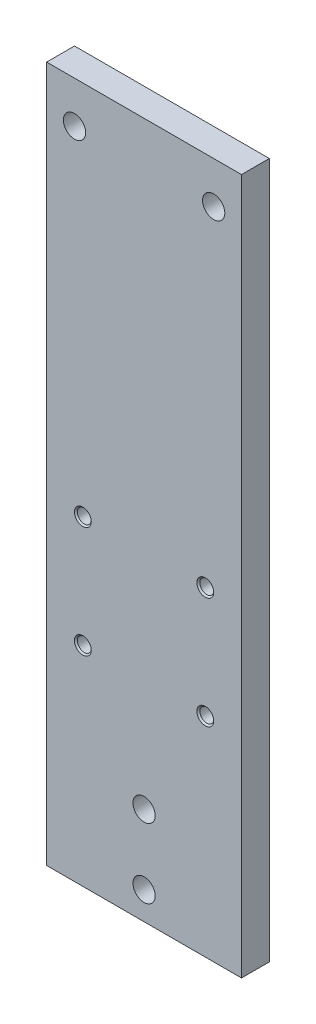
ISO-10303-21;
HEADER;
FILE_DESCRIPTION(('STEP AP214'),'2;1');
FILE_NAME('part.step','',(''),(''),'','','');
FILE_SCHEMA(('AUTOMOTIVE_DESIGN { 1 0 10303 214 1 1 1 1 }'));
ENDSEC;
DATA;
#1=APPLICATION_CONTEXT('core data for automotive mechanical design processes');
#2=APPLICATION_PROTOCOL_DEFINITION('international standard','automotive_design',2000,#1);
#3=PRODUCT_CONTEXT('',#1,'mechanical');
#4=PRODUCT('Part','Part','',(#3));
#5=PRODUCT_RELATED_PRODUCT_CATEGORY('part','',(#4));
#6=PRODUCT_DEFINITION_FORMATION('','',#4);
#7=PRODUCT_DEFINITION_CONTEXT('part definition',#1,'design');
#8=PRODUCT_DEFINITION('design','',#6,#7);
#9=PRODUCT_DEFINITION_SHAPE('','',#8);
#10=(LENGTH_UNIT() NAMED_UNIT(*) SI_UNIT(.MILLI.,.METRE.));
#11=(NAMED_UNIT(*) PLANE_ANGLE_UNIT() SI_UNIT($,.RADIAN.));
#12=(NAMED_UNIT(*) SI_UNIT($,.STERADIAN.) SOLID_ANGLE_UNIT());
#13=UNCERTAINTY_MEASURE_WITH_UNIT(LENGTH_MEASURE(1.E-05),#10,'distance_accuracy_value','');
#14=(GEOMETRIC_REPRESENTATION_CONTEXT(3) GLOBAL_UNCERTAINTY_ASSIGNED_CONTEXT((#13)) GLOBAL_UNIT_ASSIGNED_CONTEXT((#10,
#11,#12)) REPRESENTATION_CONTEXT('',''));
#15=CARTESIAN_POINT('',(0.,0.,0.));
#16=DIRECTION('',(0.,0.,1.));
#17=DIRECTION('',(1.,0.,0.));
#18=AXIS2_PLACEMENT_3D('',#15,#16,#17);
#19=CARTESIAN_POINT('',(0.,0.,10.));
#20=DIRECTION('',(0.,0.,-1.));
#21=DIRECTION('',(-1.,0.,0.));
#22=AXIS2_PLACEMENT_3D('',#19,#20,#21);
#23=PLANE('',#22);
#24=CARTESIAN_POINT('',(0.,-115.,10.));
#25=DIRECTION('',(0.,0.,1.));
#26=DIRECTION('',(1.,0.,0.));
#27=AXIS2_PLACEMENT_3D('',#24,#25,#26);
#28=CIRCLE('',#27,4.00000000000001);
#29=CARTESIAN_POINT('',(4.00000000000001,-115.,10.));
#30=VERTEX_POINT('',#29);
#31=EDGE_CURVE('E170',#30,#30,#28,.T.);
#32=ORIENTED_EDGE('',*,*,#31,.F.);
#33=EDGE_LOOP('',(#32));
#34=FACE_BOUND('',#33,.T.);
#35=CARTESIAN_POINT('',(0.,-90.,10.));
#36=DIRECTION('',(0.,0.,1.));
#37=DIRECTION('',(1.,0.,0.));
#38=AXIS2_PLACEMENT_3D('',#35,#36,#37);
#39=CIRCLE('',#38,4.00000000000001);
#40=CARTESIAN_POINT('',(4.00000000000001,-90.,10.));
#41=VERTEX_POINT('',#40);
#42=EDGE_CURVE('E164',#41,#41,#39,.T.);
#43=ORIENTED_EDGE('',*,*,#42,.F.);
#44=EDGE_LOOP('',(#43));
#45=FACE_BOUND('',#44,.T.);
#46=CARTESIAN_POINT('',(-22.,-10.,10.));
#47=DIRECTION('',(0.,0.,1.));
#48=DIRECTION('',(1.,0.,0.));
#49=AXIS2_PLACEMENT_3D('',#46,#47,#48);
#50=CIRCLE('',#49,3.025);
#51=CARTESIAN_POINT('',(-18.975,-10.,10.));
#52=VERTEX_POINT('',#51);
#53=EDGE_CURVE('E160',#52,#52,#50,.T.);
#54=ORIENTED_EDGE('',*,*,#53,.F.);
#55=EDGE_LOOP('',(#54));
#56=FACE_BOUND('',#55,.T.);
#57=CARTESIAN_POINT('',(22.,-10.,10.));
#58=DIRECTION('',(0.,0.,1.));
#59=DIRECTION('',(1.,0.,0.));
#60=AXIS2_PLACEMENT_3D('',#57,#58,#59);
#61=CIRCLE('',#60,3.025);
#62=CARTESIAN_POINT('',(25.025,-10.,10.));
#63=VERTEX_POINT('',#62);
#64=EDGE_CURVE('E151',#63,#63,#61,.T.);
#65=ORIENTED_EDGE('',*,*,#64,.F.);
#66=EDGE_LOOP('',(#65));
#67=FACE_BOUND('',#66,.T.);
#68=CARTESIAN_POINT('',(22.,-50.,10.));
#69=DIRECTION('',(0.,0.,1.));
#70=DIRECTION('',(1.,0.,0.));
#71=AXIS2_PLACEMENT_3D('',#68,#69,#70);
#72=CIRCLE('',#71,3.025);
#73=CARTESIAN_POINT('',(25.025,-50.,10.));
#74=VERTEX_POINT('',#73);
#75=EDGE_CURVE('E142',#74,#74,#72,.T.);
#76=ORIENTED_EDGE('',*,*,#75,.F.);
#77=EDGE_LOOP('',(#76));
#78=FACE_BOUND('',#77,.T.);
#79=CARTESIAN_POINT('',(-22.,-50.,10.));
#80=DIRECTION('',(0.,0.,1.));
#81=DIRECTION('',(1.,0.,0.));
#82=AXIS2_PLACEMENT_3D('',#79,#80,#81);
#83=CIRCLE('',#82,3.025);
#84=CARTESIAN_POINT('',(-18.975,-50.,10.));
#85=VERTEX_POINT('',#84);
#86=EDGE_CURVE('E133',#85,#85,#83,.T.);
#87=ORIENTED_EDGE('',*,*,#86,.F.);
#88=EDGE_LOOP('',(#87));
#89=FACE_BOUND('',#88,.T.);
#90=DIRECTION('',(0.,1.,0.));
#91=VECTOR('',#90,1.);
#92=CARTESIAN_POINT('',(35.,-125.,10.));
#93=LINE('',#92,#91);
#94=CARTESIAN_POINT('',(35.,-125.,10.));
#95=VERTEX_POINT('',#94);
#96=CARTESIAN_POINT('',(35.,125.,10.));
#97=VERTEX_POINT('',#96);
#98=EDGE_CURVE('E89',#95,#97,#93,.T.);
#99=ORIENTED_EDGE('',*,*,#98,.T.);
#100=DIRECTION('',(-1.,0.,0.));
#101=VECTOR('',#100,1.);
#102=CARTESIAN_POINT('',(-35.,125.,10.));
#103=LINE('',#102,#101);
#104=CARTESIAN_POINT('',(-35.,125.,10.));
#105=VERTEX_POINT('',#104);
#106=EDGE_CURVE('E84',#97,#105,#103,.T.);
#107=ORIENTED_EDGE('',*,*,#106,.T.);
#108=DIRECTION('',(0.,-1.,0.));
#109=VECTOR('',#108,1.);
#110=CARTESIAN_POINT('',(-35.,-125.,10.));
#111=LINE('',#110,#109);
#112=CARTESIAN_POINT('',(-35.,-125.,10.));
#113=VERTEX_POINT('',#112);
#114=EDGE_CURVE('E87',#105,#113,#111,.T.);
#115=ORIENTED_EDGE('',*,*,#114,.T.);
#116=DIRECTION('',(1.,0.,0.));
#117=VECTOR('',#116,1.);
#118=CARTESIAN_POINT('',(-35.,-125.,10.));
#119=LINE('',#118,#117);
#120=EDGE_CURVE('E54',#113,#95,#119,.T.);
#121=ORIENTED_EDGE('',*,*,#120,.T.);
#122=EDGE_LOOP('',(#99,#107,#115,#121));
#123=FACE_BOUND('',#122,.T.);
#124=CARTESIAN_POINT('',(-25.,110.,10.));
#125=DIRECTION('',(0.,0.,1.));
#126=DIRECTION('',(1.,0.,0.));
#127=AXIS2_PLACEMENT_3D('',#124,#125,#126);
#128=CIRCLE('',#127,4.);
#129=CARTESIAN_POINT('',(-21.,110.,10.));
#130=VERTEX_POINT('',#129);
#131=EDGE_CURVE('E104',#130,#130,#128,.T.);
#132=ORIENTED_EDGE('',*,*,#131,.F.);
#133=EDGE_LOOP('',(#132));
#134=FACE_BOUND('',#133,.T.);
#135=CARTESIAN_POINT('',(25.,110.,10.));
#136=DIRECTION('',(0.,0.,1.));
#137=DIRECTION('',(1.,0.,0.));
#138=AXIS2_PLACEMENT_3D('',#135,#136,#137);
#139=CIRCLE('',#138,4.);
#140=CARTESIAN_POINT('',(29.,110.,10.));
#141=VERTEX_POINT('',#140);
#142=EDGE_CURVE('E119',#141,#141,#139,.T.);
#143=ORIENTED_EDGE('',*,*,#142,.F.);
#144=EDGE_LOOP('',(#143));
#145=FACE_BOUND('',#144,.T.);
#146=ADVANCED_FACE('F37',(#34,#45,#56,#67,#78,#89,#123,#134,#145),#23,.F.);
#147=CARTESIAN_POINT('',(0.,0.,0.));
#148=DIRECTION('',(0.,0.,-1.));
#149=DIRECTION('',(-1.,0.,0.));
#150=AXIS2_PLACEMENT_3D('',#147,#148,#149);
#151=PLANE('',#150);
#152=CARTESIAN_POINT('',(0.,-115.,0.));
#153=DIRECTION('',(0.,0.,1.));
#154=DIRECTION('',(1.,0.,0.));
#155=AXIS2_PLACEMENT_3D('',#152,#153,#154);
#156=CIRCLE('',#155,4.00000000000001);
#157=CARTESIAN_POINT('',(4.00000000000001,-115.,0.));
#158=VERTEX_POINT('',#157);
#159=EDGE_CURVE('E167',#158,#158,#156,.T.);
#160=ORIENTED_EDGE('',*,*,#159,.T.);
#161=EDGE_LOOP('',(#160));
#162=FACE_BOUND('',#161,.T.);
#163=CARTESIAN_POINT('',(0.,-90.,0.));
#164=DIRECTION('',(0.,0.,1.));
#165=DIRECTION('',(1.,0.,0.));
#166=AXIS2_PLACEMENT_3D('',#163,#164,#165);
#167=CIRCLE('',#166,4.00000000000001);
#168=CARTESIAN_POINT('',(4.00000000000001,-90.,0.));
#169=VERTEX_POINT('',#168);
#170=EDGE_CURVE('E163',#169,#169,#167,.T.);
#171=ORIENTED_EDGE('',*,*,#170,.T.);
#172=EDGE_LOOP('',(#171));
#173=FACE_BOUND('',#172,.T.);
#174=CARTESIAN_POINT('',(-22.,-10.,0.));
#175=DIRECTION('',(0.,0.,1.));
#176=DIRECTION('',(1.,0.,0.));
#177=AXIS2_PLACEMENT_3D('',#174,#175,#176);
#178=CIRCLE('',#177,2.5);
#179=CARTESIAN_POINT('',(-19.5,-10.,0.));
#180=VERTEX_POINT('',#179);
#181=EDGE_CURVE('E154',#180,#180,#178,.T.);
#182=ORIENTED_EDGE('',*,*,#181,.T.);
#183=EDGE_LOOP('',(#182));
#184=FACE_BOUND('',#183,.T.);
#185=CARTESIAN_POINT('',(22.,-10.,0.));
#186=DIRECTION('',(0.,0.,1.));
#187=DIRECTION('',(1.,0.,0.));
#188=AXIS2_PLACEMENT_3D('',#185,#186,#187);
#189=CIRCLE('',#188,2.5);
#190=CARTESIAN_POINT('',(24.5,-10.,0.));
#191=VERTEX_POINT('',#190);
#192=EDGE_CURVE('E145',#191,#191,#189,.T.);
#193=ORIENTED_EDGE('',*,*,#192,.T.);
#194=EDGE_LOOP('',(#193));
#195=FACE_BOUND('',#194,.T.);
#196=CARTESIAN_POINT('',(22.,-50.,0.));
#197=DIRECTION('',(0.,0.,1.));
#198=DIRECTION('',(1.,0.,0.));
#199=AXIS2_PLACEMENT_3D('',#196,#197,#198);
#200=CIRCLE('',#199,2.5);
#201=CARTESIAN_POINT('',(24.5,-50.,0.));
#202=VERTEX_POINT('',#201);
#203=EDGE_CURVE('E136',#202,#202,#200,.T.);
#204=ORIENTED_EDGE('',*,*,#203,.T.);
#205=EDGE_LOOP('',(#204));
#206=FACE_BOUND('',#205,.T.);
#207=CARTESIAN_POINT('',(-22.,-50.,0.));
#208=DIRECTION('',(0.,0.,1.));
#209=DIRECTION('',(1.,0.,0.));
#210=AXIS2_PLACEMENT_3D('',#207,#208,#209);
#211=CIRCLE('',#210,2.5);
#212=CARTESIAN_POINT('',(-19.5,-50.,0.));
#213=VERTEX_POINT('',#212);
#214=EDGE_CURVE('E125',#213,#213,#211,.T.);
#215=ORIENTED_EDGE('',*,*,#214,.T.);
#216=EDGE_LOOP('',(#215));
#217=FACE_BOUND('',#216,.T.);
#218=CARTESIAN_POINT('',(-25.,110.,0.));
#219=DIRECTION('',(0.,0.,1.));
#220=DIRECTION('',(1.,0.,0.));
#221=AXIS2_PLACEMENT_3D('',#218,#219,#220);
#222=CIRCLE('',#221,4.);
#223=CARTESIAN_POINT('',(-21.,110.,0.));
#224=VERTEX_POINT('',#223);
#225=EDGE_CURVE('E116',#224,#224,#222,.T.);
#226=ORIENTED_EDGE('',*,*,#225,.T.);
#227=EDGE_LOOP('',(#226));
#228=FACE_BOUND('',#227,.T.);
#229=DIRECTION('',(0.,1.,0.));
#230=VECTOR('',#229,1.);
#231=CARTESIAN_POINT('',(35.,-125.,0.));
#232=LINE('',#231,#230);
#233=CARTESIAN_POINT('',(35.,-125.,0.));
#234=VERTEX_POINT('',#233);
#235=CARTESIAN_POINT('',(35.,125.,0.));
#236=VERTEX_POINT('',#235);
#237=EDGE_CURVE('E101',#234,#236,#232,.T.);
#238=ORIENTED_EDGE('',*,*,#237,.F.);
#239=DIRECTION('',(1.,0.,0.));
#240=VECTOR('',#239,1.);
#241=CARTESIAN_POINT('',(-35.,-125.,0.));
#242=LINE('',#241,#240);
#243=CARTESIAN_POINT('',(-35.,-125.,0.));
#244=VERTEX_POINT('',#243);
#245=EDGE_CURVE('E77',#244,#234,#242,.T.);
#246=ORIENTED_EDGE('',*,*,#245,.F.);
#247=DIRECTION('',(0.,-1.,0.));
#248=VECTOR('',#247,1.);
#249=CARTESIAN_POINT('',(-35.,-125.,0.));
#250=LINE('',#249,#248);
#251=CARTESIAN_POINT('',(-35.,125.,0.));
#252=VERTEX_POINT('',#251);
#253=EDGE_CURVE('E71',#252,#244,#250,.T.);
#254=ORIENTED_EDGE('',*,*,#253,.F.);
#255=DIRECTION('',(-1.,0.,0.));
#256=VECTOR('',#255,1.);
#257=CARTESIAN_POINT('',(-35.,125.,0.));
#258=LINE('',#257,#256);
#259=EDGE_CURVE('E93',#236,#252,#258,.T.);
#260=ORIENTED_EDGE('',*,*,#259,.F.);
#261=EDGE_LOOP('',(#238,#246,#254,#260));
#262=FACE_BOUND('',#261,.T.);
#263=CARTESIAN_POINT('',(25.,110.,0.));
#264=DIRECTION('',(0.,0.,1.));
#265=DIRECTION('',(1.,0.,0.));
#266=AXIS2_PLACEMENT_3D('',#263,#264,#265);
#267=CIRCLE('',#266,4.);
#268=CARTESIAN_POINT('',(29.,110.,0.));
#269=VERTEX_POINT('',#268);
#270=EDGE_CURVE('E122',#269,#269,#267,.T.);
#271=ORIENTED_EDGE('',*,*,#270,.T.);
#272=EDGE_LOOP('',(#271));
#273=FACE_BOUND('',#272,.T.);
#274=ADVANCED_FACE('F112',(#162,#173,#184,#195,#206,#217,#228,#262,#273),#151,.T.);
#275=CARTESIAN_POINT('',(35.,-125.,10.));
#276=DIRECTION('',(-1.,0.,0.));
#277=DIRECTION('',(0.,0.,1.));
#278=AXIS2_PLACEMENT_3D('',#275,#276,#277);
#279=PLANE('',#278);
#280=ORIENTED_EDGE('',*,*,#237,.T.);
#281=DIRECTION('',(0.,0.,-1.));
#282=VECTOR('',#281,1.);
#283=CARTESIAN_POINT('',(35.,125.,10.));
#284=LINE('',#283,#282);
#285=EDGE_CURVE('E11',#97,#236,#284,.T.);
#286=ORIENTED_EDGE('',*,*,#285,.F.);
#287=ORIENTED_EDGE('',*,*,#98,.F.);
#288=DIRECTION('',(0.,0.,-1.));
#289=VECTOR('',#288,1.);
#290=CARTESIAN_POINT('',(35.,-125.,10.));
#291=LINE('',#290,#289);
#292=EDGE_CURVE('E97',#95,#234,#291,.T.);
#293=ORIENTED_EDGE('',*,*,#292,.T.);
#294=EDGE_LOOP('',(#280,#286,#287,#293));
#295=FACE_BOUND('',#294,.T.);
#296=ADVANCED_FACE('F39',(#295),#279,.F.);
#297=CARTESIAN_POINT('',(-35.,125.,10.));
#298=DIRECTION('',(0.,-1.,0.));
#299=DIRECTION('',(0.,0.,-1.));
#300=AXIS2_PLACEMENT_3D('',#297,#298,#299);
#301=PLANE('',#300);
#302=ORIENTED_EDGE('',*,*,#259,.T.);
#303=DIRECTION('',(0.,0.,-1.));
#304=VECTOR('',#303,1.);
#305=CARTESIAN_POINT('',(-35.,125.,10.));
#306=LINE('',#305,#304);
#307=EDGE_CURVE('E46',#105,#252,#306,.T.);
#308=ORIENTED_EDGE('',*,*,#307,.F.);
#309=ORIENTED_EDGE('',*,*,#106,.F.);
#310=ORIENTED_EDGE('',*,*,#285,.T.);
#311=EDGE_LOOP('',(#302,#308,#309,#310));
#312=FACE_BOUND('',#311,.T.);
#313=ADVANCED_FACE('F92',(#312),#301,.F.);
#314=CARTESIAN_POINT('',(-35.,-125.,10.));
#315=DIRECTION('',(1.,0.,0.));
#316=DIRECTION('',(0.,0.,-1.));
#317=AXIS2_PLACEMENT_3D('',#314,#315,#316);
#318=PLANE('',#317);
#319=ORIENTED_EDGE('',*,*,#253,.T.);
#320=DIRECTION('',(0.,0.,-1.));
#321=VECTOR('',#320,1.);
#322=CARTESIAN_POINT('',(-35.,-125.,10.));
#323=LINE('',#322,#321);
#324=EDGE_CURVE('E94',#113,#244,#323,.T.);
#325=ORIENTED_EDGE('',*,*,#324,.F.);
#326=ORIENTED_EDGE('',*,*,#114,.F.);
#327=ORIENTED_EDGE('',*,*,#307,.T.);
#328=EDGE_LOOP('',(#319,#325,#326,#327));
#329=FACE_BOUND('',#328,.T.);
#330=ADVANCED_FACE('F95',(#329),#318,.F.);
#331=CARTESIAN_POINT('',(-35.,-125.,10.));
#332=DIRECTION('',(0.,1.,0.));
#333=DIRECTION('',(0.,0.,1.));
#334=AXIS2_PLACEMENT_3D('',#331,#332,#333);
#335=PLANE('',#334);
#336=ORIENTED_EDGE('',*,*,#245,.T.);
#337=ORIENTED_EDGE('',*,*,#292,.F.);
#338=ORIENTED_EDGE('',*,*,#120,.F.);
#339=ORIENTED_EDGE('',*,*,#324,.T.);
#340=EDGE_LOOP('',(#336,#337,#338,#339));
#341=FACE_BOUND('',#340,.T.);
#342=ADVANCED_FACE('F109',(#341),#335,.F.);
#343=CARTESIAN_POINT('',(-25.,110.,10.));
#344=DIRECTION('',(0.,0.,-1.));
#345=DIRECTION('',(-1.,0.,0.));
#346=AXIS2_PLACEMENT_3D('',#343,#344,#345);
#347=CYLINDRICAL_SURFACE('',#346,4.);
#348=ORIENTED_EDGE('',*,*,#131,.T.);
#349=EDGE_LOOP('',(#348));
#350=FACE_BOUND('',#349,.T.);
#351=ORIENTED_EDGE('',*,*,#225,.F.);
#352=EDGE_LOOP('',(#351));
#353=FACE_BOUND('',#352,.T.);
#354=ADVANCED_FACE('F219',(#350,#353),#347,.F.);
#355=CARTESIAN_POINT('',(25.,110.,10.));
#356=DIRECTION('',(0.,0.,-1.));
#357=DIRECTION('',(-1.,0.,0.));
#358=AXIS2_PLACEMENT_3D('',#355,#356,#357);
#359=CYLINDRICAL_SURFACE('',#358,4.);
#360=ORIENTED_EDGE('',*,*,#142,.T.);
#361=EDGE_LOOP('',(#360));
#362=FACE_BOUND('',#361,.T.);
#363=ORIENTED_EDGE('',*,*,#270,.F.);
#364=EDGE_LOOP('',(#363));
#365=FACE_BOUND('',#364,.T.);
#366=ADVANCED_FACE('F211',(#362,#365),#359,.F.);
#367=CARTESIAN_POINT('',(-22.,-50.,10.));
#368=DIRECTION('',(0.,0.,1.));
#369=DIRECTION('',(1.,0.,0.));
#370=AXIS2_PLACEMENT_3D('',#367,#368,#369);
#371=CYLINDRICAL_SURFACE('',#370,2.49999999999999);
#372=ORIENTED_EDGE('',*,*,#214,.F.);
#373=EDGE_LOOP('',(#372));
#374=FACE_BOUND('',#373,.T.);
#375=CARTESIAN_POINT('',(-22.,-50.,9.47499999999997));
#376=DIRECTION('',(0.,0.,1.));
#377=DIRECTION('',(1.,0.,0.));
#378=AXIS2_PLACEMENT_3D('',#375,#376,#377);
#379=CIRCLE('',#378,2.49999999999999);
#380=CARTESIAN_POINT('',(-19.5,-50.,9.47499999999997));
#381=VERTEX_POINT('',#380);
#382=EDGE_CURVE('E130',#381,#381,#379,.T.);
#383=ORIENTED_EDGE('',*,*,#382,.T.);
#384=EDGE_LOOP('',(#383));
#385=FACE_BOUND('',#384,.T.);
#386=ADVANCED_FACE('F201',(#374,#385),#371,.F.);
#387=CARTESIAN_POINT('',(-22.,-50.,10.));
#388=DIRECTION('',(0.,0.,1.));
#389=DIRECTION('',(1.,0.,0.));
#390=AXIS2_PLACEMENT_3D('',#387,#388,#389);
#391=CONICAL_SURFACE('',#390,3.025,0.785398163397433);
#392=ORIENTED_EDGE('',*,*,#382,.F.);
#393=EDGE_LOOP('',(#392));
#394=FACE_BOUND('',#393,.T.);
#395=ORIENTED_EDGE('',*,*,#86,.T.);
#396=EDGE_LOOP('',(#395));
#397=FACE_BOUND('',#396,.T.);
#398=ADVANCED_FACE('F198',(#394,#397),#391,.F.);
#399=CARTESIAN_POINT('',(22.,-50.,10.));
#400=DIRECTION('',(0.,0.,1.));
#401=DIRECTION('',(1.,0.,0.));
#402=AXIS2_PLACEMENT_3D('',#399,#400,#401);
#403=CYLINDRICAL_SURFACE('',#402,2.49999999999999);
#404=ORIENTED_EDGE('',*,*,#203,.F.);
#405=EDGE_LOOP('',(#404));
#406=FACE_BOUND('',#405,.T.);
#407=CARTESIAN_POINT('',(22.,-50.,9.47499999999997));
#408=DIRECTION('',(0.,0.,1.));
#409=DIRECTION('',(1.,0.,0.));
#410=AXIS2_PLACEMENT_3D('',#407,#408,#409);
#411=CIRCLE('',#410,2.49999999999999);
#412=CARTESIAN_POINT('',(24.5,-50.,9.47499999999997));
#413=VERTEX_POINT('',#412);
#414=EDGE_CURVE('E139',#413,#413,#411,.T.);
#415=ORIENTED_EDGE('',*,*,#414,.T.);
#416=EDGE_LOOP('',(#415));
#417=FACE_BOUND('',#416,.T.);
#418=ADVANCED_FACE('F200',(#406,#417),#403,.F.);
#419=CARTESIAN_POINT('',(22.,-50.,10.));
#420=DIRECTION('',(0.,0.,1.));
#421=DIRECTION('',(1.,0.,0.));
#422=AXIS2_PLACEMENT_3D('',#419,#420,#421);
#423=CONICAL_SURFACE('',#422,3.025,0.785398163397433);
#424=ORIENTED_EDGE('',*,*,#414,.F.);
#425=EDGE_LOOP('',(#424));
#426=FACE_BOUND('',#425,.T.);
#427=ORIENTED_EDGE('',*,*,#75,.T.);
#428=EDGE_LOOP('',(#427));
#429=FACE_BOUND('',#428,.T.);
#430=ADVANCED_FACE('F208',(#426,#429),#423,.F.);
#431=CARTESIAN_POINT('',(22.,-10.,10.));
#432=DIRECTION('',(0.,0.,1.));
#433=DIRECTION('',(1.,0.,0.));
#434=AXIS2_PLACEMENT_3D('',#431,#432,#433);
#435=CYLINDRICAL_SURFACE('',#434,2.49999999999999);
#436=ORIENTED_EDGE('',*,*,#192,.F.);
#437=EDGE_LOOP('',(#436));
#438=FACE_BOUND('',#437,.T.);
#439=CARTESIAN_POINT('',(22.,-10.,9.47499999999997));
#440=DIRECTION('',(0.,0.,1.));
#441=DIRECTION('',(1.,0.,0.));
#442=AXIS2_PLACEMENT_3D('',#439,#440,#441);
#443=CIRCLE('',#442,2.49999999999999);
#444=CARTESIAN_POINT('',(24.5,-10.,9.47499999999997));
#445=VERTEX_POINT('',#444);
#446=EDGE_CURVE('E148',#445,#445,#443,.T.);
#447=ORIENTED_EDGE('',*,*,#446,.T.);
#448=EDGE_LOOP('',(#447));
#449=FACE_BOUND('',#448,.T.);
#450=ADVANCED_FACE('F278',(#438,#449),#435,.F.);
#451=CARTESIAN_POINT('',(22.,-10.,10.));
#452=DIRECTION('',(0.,0.,1.));
#453=DIRECTION('',(1.,0.,0.));
#454=AXIS2_PLACEMENT_3D('',#451,#452,#453);
#455=CONICAL_SURFACE('',#454,3.025,0.785398163397433);
#456=ORIENTED_EDGE('',*,*,#446,.F.);
#457=EDGE_LOOP('',(#456));
#458=FACE_BOUND('',#457,.T.);
#459=ORIENTED_EDGE('',*,*,#64,.T.);
#460=EDGE_LOOP('',(#459));
#461=FACE_BOUND('',#460,.T.);
#462=ADVANCED_FACE('F267',(#458,#461),#455,.F.);
#463=CARTESIAN_POINT('',(-22.,-10.,10.));
#464=DIRECTION('',(0.,0.,1.));
#465=DIRECTION('',(1.,0.,0.));
#466=AXIS2_PLACEMENT_3D('',#463,#464,#465);
#467=CYLINDRICAL_SURFACE('',#466,2.49999999999999);
#468=ORIENTED_EDGE('',*,*,#181,.F.);
#469=EDGE_LOOP('',(#468));
#470=FACE_BOUND('',#469,.T.);
#471=CARTESIAN_POINT('',(-22.,-10.,9.47499999999997));
#472=DIRECTION('',(0.,0.,1.));
#473=DIRECTION('',(1.,0.,0.));
#474=AXIS2_PLACEMENT_3D('',#471,#472,#473);
#475=CIRCLE('',#474,2.49999999999999);
#476=CARTESIAN_POINT('',(-19.5,-10.,9.47499999999997));
#477=VERTEX_POINT('',#476);
#478=EDGE_CURVE('E157',#477,#477,#475,.T.);
#479=ORIENTED_EDGE('',*,*,#478,.T.);
#480=EDGE_LOOP('',(#479));
#481=FACE_BOUND('',#480,.T.);
#482=ADVANCED_FACE('F254',(#470,#481),#467,.F.);
#483=CARTESIAN_POINT('',(-22.,-10.,10.));
#484=DIRECTION('',(0.,0.,1.));
#485=DIRECTION('',(1.,0.,0.));
#486=AXIS2_PLACEMENT_3D('',#483,#484,#485);
#487=CONICAL_SURFACE('',#486,3.025,0.785398163397433);
#488=ORIENTED_EDGE('',*,*,#478,.F.);
#489=EDGE_LOOP('',(#488));
#490=FACE_BOUND('',#489,.T.);
#491=ORIENTED_EDGE('',*,*,#53,.T.);
#492=EDGE_LOOP('',(#491));
#493=FACE_BOUND('',#492,.T.);
#494=ADVANCED_FACE('F249',(#490,#493),#487,.F.);
#495=CARTESIAN_POINT('',(0.,-90.,0.));
#496=DIRECTION('',(0.,0.,1.));
#497=DIRECTION('',(1.,0.,0.));
#498=AXIS2_PLACEMENT_3D('',#495,#496,#497);
#499=CYLINDRICAL_SURFACE('',#498,4.00000000000001);
#500=ORIENTED_EDGE('',*,*,#170,.F.);
#501=EDGE_LOOP('',(#500));
#502=FACE_BOUND('',#501,.T.);
#503=ORIENTED_EDGE('',*,*,#42,.T.);
#504=EDGE_LOOP('',(#503));
#505=FACE_BOUND('',#504,.T.);
#506=ADVANCED_FACE('F181',(#502,#505),#499,.F.);
#507=CARTESIAN_POINT('',(0.,-115.,0.));
#508=DIRECTION('',(0.,0.,1.));
#509=DIRECTION('',(1.,0.,0.));
#510=AXIS2_PLACEMENT_3D('',#507,#508,#509);
#511=CYLINDRICAL_SURFACE('',#510,4.00000000000001);
#512=ORIENTED_EDGE('',*,*,#159,.F.);
#513=EDGE_LOOP('',(#512));
#514=FACE_BOUND('',#513,.T.);
#515=ORIENTED_EDGE('',*,*,#31,.T.);
#516=EDGE_LOOP('',(#515));
#517=FACE_BOUND('',#516,.T.);
#518=ADVANCED_FACE('F178',(#514,#517),#511,.F.);
#519=CLOSED_SHELL('',(#146,#274,#296,#313,#330,#342,#354,#366,#386,#398,#418,#430,#450,#462,
#482,#494,#506,#518));
#520=MANIFOLD_SOLID_BREP('B2',#519);
#521=ADVANCED_BREP_SHAPE_REPRESENTATION('',(#18,#520),#14);
#522=SHAPE_DEFINITION_REPRESENTATION(#9,#521);
ENDSEC;
END-ISO-10303-21;
